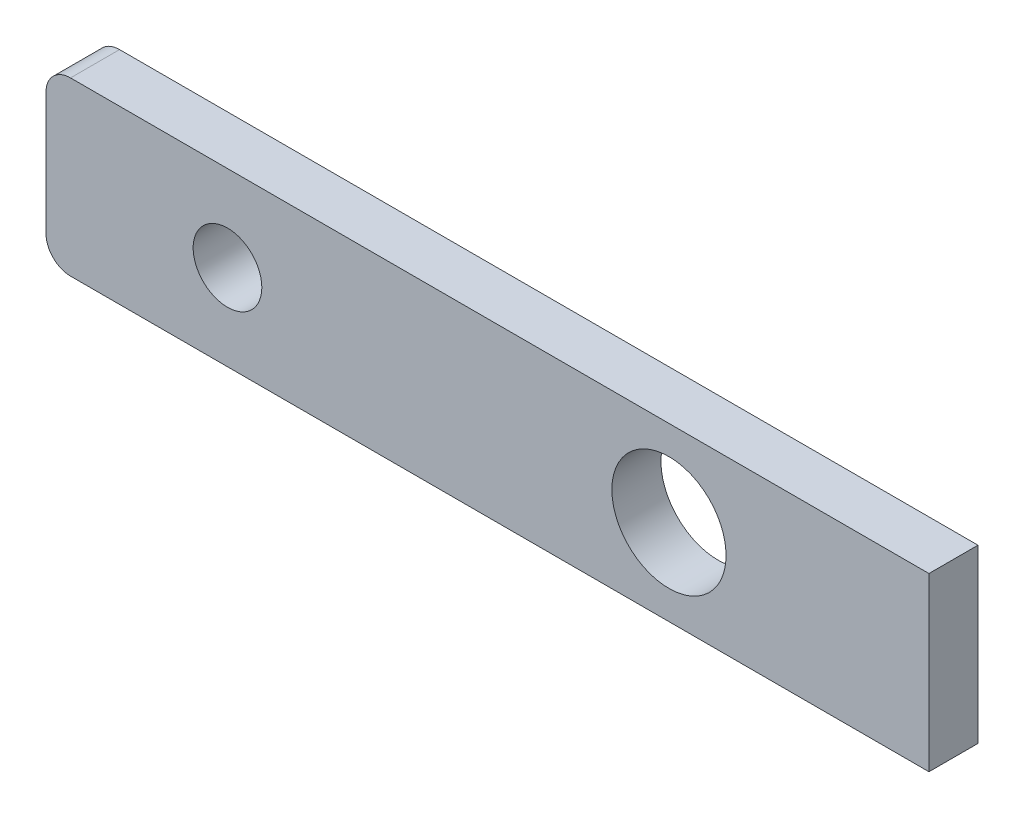
ISO-10303-21;
HEADER;
FILE_DESCRIPTION(('STEP AP214'),'2;1');
FILE_NAME('part.step','',(''),(''),'','','');
FILE_SCHEMA(('AUTOMOTIVE_DESIGN { 1 0 10303 214 1 1 1 1 }'));
ENDSEC;
DATA;
#1=APPLICATION_CONTEXT('core data for automotive mechanical design processes');
#2=APPLICATION_PROTOCOL_DEFINITION('international standard','automotive_design',2000,#1);
#3=PRODUCT_CONTEXT('',#1,'mechanical');
#4=PRODUCT('Part','Part','',(#3));
#5=PRODUCT_RELATED_PRODUCT_CATEGORY('part','',(#4));
#6=PRODUCT_DEFINITION_FORMATION('','',#4);
#7=PRODUCT_DEFINITION_CONTEXT('part definition',#1,'design');
#8=PRODUCT_DEFINITION('design','',#6,#7);
#9=PRODUCT_DEFINITION_SHAPE('','',#8);
#10=(LENGTH_UNIT() NAMED_UNIT(*) SI_UNIT(.MILLI.,.METRE.));
#11=(NAMED_UNIT(*) PLANE_ANGLE_UNIT() SI_UNIT($,.RADIAN.));
#12=(NAMED_UNIT(*) SI_UNIT($,.STERADIAN.) SOLID_ANGLE_UNIT());
#13=UNCERTAINTY_MEASURE_WITH_UNIT(LENGTH_MEASURE(1.E-05),#10,'distance_accuracy_value','');
#14=(GEOMETRIC_REPRESENTATION_CONTEXT(3) GLOBAL_UNCERTAINTY_ASSIGNED_CONTEXT((#13)) GLOBAL_UNIT_ASSIGNED_CONTEXT((#10,
#11,#12)) REPRESENTATION_CONTEXT('',''));
#15=CARTESIAN_POINT('',(0.,0.,0.));
#16=DIRECTION('',(0.,0.,1.));
#17=DIRECTION('',(1.,0.,0.));
#18=AXIS2_PLACEMENT_3D('',#15,#16,#17);
#19=CARTESIAN_POINT('',(8.99999999999995,1.75000000000002,1.));
#20=DIRECTION('',(-1.,0.,0.));
#21=DIRECTION('',(0.,-1.,0.));
#22=AXIS2_PLACEMENT_3D('',#19,#20,#21);
#23=PLANE('',#22);
#24=DIRECTION('',(0.,1.,0.));
#25=VECTOR('',#24,1.);
#26=CARTESIAN_POINT('',(8.99999999999995,1.75000000000002,0.));
#27=LINE('',#26,#25);
#28=CARTESIAN_POINT('',(8.99999999999998,-1.74999999999998,0.));
#29=VERTEX_POINT('',#28);
#30=CARTESIAN_POINT('',(8.99999999999995,1.75000000000002,0.));
#31=VERTEX_POINT('',#30);
#32=EDGE_CURVE('E107',#29,#31,#27,.T.);
#33=ORIENTED_EDGE('',*,*,#32,.T.);
#34=DIRECTION('',(0.,0.,-1.));
#35=VECTOR('',#34,1.);
#36=CARTESIAN_POINT('',(8.99999999999995,1.75000000000002,1.));
#37=LINE('',#36,#35);
#38=CARTESIAN_POINT('',(8.99999999999995,1.75000000000002,1.));
#39=VERTEX_POINT('',#38);
#40=EDGE_CURVE('E90',#39,#31,#37,.T.);
#41=ORIENTED_EDGE('',*,*,#40,.F.);
#42=DIRECTION('',(0.,1.,0.));
#43=VECTOR('',#42,1.);
#44=CARTESIAN_POINT('',(8.99999999999995,1.75000000000002,1.));
#45=LINE('',#44,#43);
#46=CARTESIAN_POINT('',(8.99999999999998,-1.74999999999998,1.));
#47=VERTEX_POINT('',#46);
#48=EDGE_CURVE('E95',#47,#39,#45,.T.);
#49=ORIENTED_EDGE('',*,*,#48,.F.);
#50=DIRECTION('',(0.,0.,-1.));
#51=VECTOR('',#50,1.);
#52=CARTESIAN_POINT('',(8.99999999999998,-1.74999999999998,1.));
#53=LINE('',#52,#51);
#54=EDGE_CURVE('E109',#47,#29,#53,.T.);
#55=ORIENTED_EDGE('',*,*,#54,.T.);
#56=EDGE_LOOP('',(#33,#41,#49,#55));
#57=FACE_BOUND('',#56,.T.);
#58=ADVANCED_FACE('F34',(#57),#23,.F.);
#59=CARTESIAN_POINT('',(-9.00000000000001,1.75000000000002,1.));
#60=DIRECTION('',(0.,-1.,0.));
#61=DIRECTION('',(0.,0.,-1.));
#62=AXIS2_PLACEMENT_3D('',#59,#60,#61);
#63=PLANE('',#62);
#64=DIRECTION('',(-1.,0.,0.));
#65=VECTOR('',#64,1.);
#66=CARTESIAN_POINT('',(-9.00000000000001,1.75000000000002,0.));
#67=LINE('',#66,#65);
#68=CARTESIAN_POINT('',(-8.50000000000001,1.75000000000002,0.));
#69=VERTEX_POINT('',#68);
#70=EDGE_CURVE('E139',#31,#69,#67,.T.);
#71=ORIENTED_EDGE('',*,*,#70,.T.);
#72=DIRECTION('',(0.,0.,-1.));
#73=VECTOR('',#72,1.);
#74=CARTESIAN_POINT('',(-8.50000000000001,1.75000000000002,1.));
#75=LINE('',#74,#73);
#76=CARTESIAN_POINT('',(-8.50000000000001,1.75000000000002,1.));
#77=VERTEX_POINT('',#76);
#78=EDGE_CURVE('E12',#69,#77,#75,.F.);
#79=ORIENTED_EDGE('',*,*,#78,.T.);
#80=DIRECTION('',(-1.,0.,0.));
#81=VECTOR('',#80,1.);
#82=CARTESIAN_POINT('',(-9.00000000000001,1.75000000000002,1.));
#83=LINE('',#82,#81);
#84=EDGE_CURVE('E86',#39,#77,#83,.T.);
#85=ORIENTED_EDGE('',*,*,#84,.F.);
#86=ORIENTED_EDGE('',*,*,#40,.T.);
#87=EDGE_LOOP('',(#71,#79,#85,#86));
#88=FACE_BOUND('',#87,.T.);
#89=ADVANCED_FACE('F88',(#88),#63,.F.);
#90=CARTESIAN_POINT('',(-9.00000000000001,1.75000000000002,1.));
#91=DIRECTION('',(1.,0.,0.));
#92=DIRECTION('',(0.,0.,-1.));
#93=AXIS2_PLACEMENT_3D('',#90,#91,#92);
#94=PLANE('',#93);
#95=DIRECTION('',(0.,-1.,0.));
#96=VECTOR('',#95,1.);
#97=CARTESIAN_POINT('',(-9.00000000000001,1.75000000000002,0.));
#98=LINE('',#97,#96);
#99=CARTESIAN_POINT('',(-9.00000000000001,1.25000000000002,0.));
#100=VERTEX_POINT('',#99);
#101=CARTESIAN_POINT('',(-9.00000000000001,-1.24999999999999,0.));
#102=VERTEX_POINT('',#101);
#103=EDGE_CURVE('E136',#100,#102,#98,.T.);
#104=ORIENTED_EDGE('',*,*,#103,.T.);
#105=DIRECTION('',(0.,0.,-1.));
#106=VECTOR('',#105,1.);
#107=CARTESIAN_POINT('',(-9.00000000000001,-1.24999999999999,1.));
#108=LINE('',#107,#106);
#109=CARTESIAN_POINT('',(-9.00000000000001,-1.24999999999999,1.));
#110=VERTEX_POINT('',#109);
#111=EDGE_CURVE('E55',#102,#110,#108,.F.);
#112=ORIENTED_EDGE('',*,*,#111,.T.);
#113=DIRECTION('',(0.,-1.,0.));
#114=VECTOR('',#113,1.);
#115=CARTESIAN_POINT('',(-9.00000000000001,1.75000000000002,1.));
#116=LINE('',#115,#114);
#117=CARTESIAN_POINT('',(-9.00000000000001,1.25000000000002,1.));
#118=VERTEX_POINT('',#117);
#119=EDGE_CURVE('E94',#118,#110,#116,.T.);
#120=ORIENTED_EDGE('',*,*,#119,.F.);
#121=DIRECTION('',(0.,0.,-1.));
#122=VECTOR('',#121,1.);
#123=CARTESIAN_POINT('',(-9.00000000000001,1.25000000000002,1.));
#124=LINE('',#123,#122);
#125=EDGE_CURVE('E120',#118,#100,#124,.T.);
#126=ORIENTED_EDGE('',*,*,#125,.T.);
#127=EDGE_LOOP('',(#104,#112,#120,#126));
#128=FACE_BOUND('',#127,.T.);
#129=ADVANCED_FACE('F137',(#128),#94,.F.);
#130=CARTESIAN_POINT('',(-9.00000000000001,-1.74999999999999,1.));
#131=DIRECTION('',(0.,1.,0.));
#132=DIRECTION('',(-1.,0.,0.));
#133=AXIS2_PLACEMENT_3D('',#130,#131,#132);
#134=PLANE('',#133);
#135=DIRECTION('',(1.,0.,0.));
#136=VECTOR('',#135,1.);
#137=CARTESIAN_POINT('',(-9.00000000000001,-1.74999999999999,1.));
#138=LINE('',#137,#136);
#139=CARTESIAN_POINT('',(-8.50000000000001,-1.74999999999999,1.));
#140=VERTEX_POINT('',#139);
#141=EDGE_CURVE('E100',#140,#47,#138,.T.);
#142=ORIENTED_EDGE('',*,*,#141,.F.);
#143=DIRECTION('',(0.,0.,-1.));
#144=VECTOR('',#143,1.);
#145=CARTESIAN_POINT('',(-8.50000000000001,-1.74999999999999,1.));
#146=LINE('',#145,#144);
#147=CARTESIAN_POINT('',(-8.50000000000001,-1.74999999999999,0.));
#148=VERTEX_POINT('',#147);
#149=EDGE_CURVE('E108',#140,#148,#146,.T.);
#150=ORIENTED_EDGE('',*,*,#149,.T.);
#151=DIRECTION('',(1.,0.,0.));
#152=VECTOR('',#151,1.);
#153=CARTESIAN_POINT('',(-9.00000000000001,-1.74999999999999,0.));
#154=LINE('',#153,#152);
#155=EDGE_CURVE('E104',#148,#29,#154,.T.);
#156=ORIENTED_EDGE('',*,*,#155,.T.);
#157=ORIENTED_EDGE('',*,*,#54,.F.);
#158=EDGE_LOOP('',(#142,#150,#156,#157));
#159=FACE_BOUND('',#158,.T.);
#160=ADVANCED_FACE('F129',(#159),#134,.F.);
#161=CARTESIAN_POINT('',(0.,0.,1.));
#162=DIRECTION('',(0.,0.,1.));
#163=DIRECTION('',(1.,0.,0.));
#164=AXIS2_PLACEMENT_3D('',#161,#162,#163);
#165=PLANE('',#164);
#166=CARTESIAN_POINT('',(3.7,0.,1.));
#167=DIRECTION('',(0.,0.,-1.));
#168=DIRECTION('',(-1.,0.,0.));
#169=AXIS2_PLACEMENT_3D('',#166,#167,#168);
#170=CIRCLE('',#169,1.16401377661176);
#171=CARTESIAN_POINT('',(2.53598622338824,0.,1.));
#172=VERTEX_POINT('',#171);
#173=EDGE_CURVE('E149',#172,#172,#170,.T.);
#174=ORIENTED_EDGE('',*,*,#173,.T.);
#175=EDGE_LOOP('',(#174));
#176=FACE_BOUND('',#175,.T.);
#177=CARTESIAN_POINT('',(-5.30000000000001,0.,1.));
#178=DIRECTION('',(0.,0.,1.));
#179=DIRECTION('',(1.,0.,0.));
#180=AXIS2_PLACEMENT_3D('',#177,#178,#179);
#181=CIRCLE('',#180,0.7);
#182=CARTESIAN_POINT('',(-4.60000000000001,0.,1.));
#183=VERTEX_POINT('',#182);
#184=EDGE_CURVE('E146',#183,#183,#181,.T.);
#185=ORIENTED_EDGE('',*,*,#184,.F.);
#186=EDGE_LOOP('',(#185));
#187=FACE_BOUND('',#186,.T.);
#188=ORIENTED_EDGE('',*,*,#119,.T.);
#189=CARTESIAN_POINT('',(-8.50000000000001,-1.24999999999999,1.));
#190=DIRECTION('',(0.,0.,1.));
#191=DIRECTION('',(1.,0.,0.));
#192=AXIS2_PLACEMENT_3D('',#189,#190,#191);
#193=CIRCLE('',#192,0.5);
#194=EDGE_CURVE('E42',#110,#140,#193,.T.);
#195=ORIENTED_EDGE('',*,*,#194,.T.);
#196=ORIENTED_EDGE('',*,*,#141,.T.);
#197=ORIENTED_EDGE('',*,*,#48,.T.);
#198=ORIENTED_EDGE('',*,*,#84,.T.);
#199=CARTESIAN_POINT('',(-8.50000000000001,1.25000000000002,1.));
#200=DIRECTION('',(0.,0.,1.));
#201=DIRECTION('',(1.,0.,0.));
#202=AXIS2_PLACEMENT_3D('',#199,#200,#201);
#203=CIRCLE('',#202,0.5);
#204=EDGE_CURVE('E124',#77,#118,#203,.T.);
#205=ORIENTED_EDGE('',*,*,#204,.T.);
#206=EDGE_LOOP('',(#188,#195,#196,#197,#198,#205));
#207=FACE_BOUND('',#206,.T.);
#208=ADVANCED_FACE('F98',(#176,#187,#207),#165,.T.);
#209=CARTESIAN_POINT('',(0.,0.,0.));
#210=DIRECTION('',(0.,0.,1.));
#211=DIRECTION('',(1.,0.,0.));
#212=AXIS2_PLACEMENT_3D('',#209,#210,#211);
#213=PLANE('',#212);
#214=CARTESIAN_POINT('',(3.7,0.,0.));
#215=DIRECTION('',(0.,0.,-1.));
#216=DIRECTION('',(-1.,0.,0.));
#217=AXIS2_PLACEMENT_3D('',#214,#215,#216);
#218=CIRCLE('',#217,1.16401377661176);
#219=CARTESIAN_POINT('',(2.53598622338824,0.,0.));
#220=VERTEX_POINT('',#219);
#221=EDGE_CURVE('E152',#220,#220,#218,.T.);
#222=ORIENTED_EDGE('',*,*,#221,.F.);
#223=EDGE_LOOP('',(#222));
#224=FACE_BOUND('',#223,.T.);
#225=CARTESIAN_POINT('',(-5.30000000000001,0.,0.));
#226=DIRECTION('',(0.,0.,1.));
#227=DIRECTION('',(1.,0.,0.));
#228=AXIS2_PLACEMENT_3D('',#225,#226,#227);
#229=CIRCLE('',#228,0.7);
#230=CARTESIAN_POINT('',(-4.60000000000001,0.,0.));
#231=VERTEX_POINT('',#230);
#232=EDGE_CURVE('E143',#231,#231,#229,.T.);
#233=ORIENTED_EDGE('',*,*,#232,.T.);
#234=EDGE_LOOP('',(#233));
#235=FACE_BOUND('',#234,.T.);
#236=ORIENTED_EDGE('',*,*,#155,.F.);
#237=CARTESIAN_POINT('',(-8.50000000000001,-1.24999999999999,0.));
#238=DIRECTION('',(0.,0.,1.));
#239=DIRECTION('',(1.,0.,0.));
#240=AXIS2_PLACEMENT_3D('',#237,#238,#239);
#241=CIRCLE('',#240,0.5);
#242=EDGE_CURVE('E118',#148,#102,#241,.F.);
#243=ORIENTED_EDGE('',*,*,#242,.T.);
#244=ORIENTED_EDGE('',*,*,#103,.F.);
#245=CARTESIAN_POINT('',(-8.50000000000001,1.25000000000002,0.));
#246=DIRECTION('',(0.,0.,1.));
#247=DIRECTION('',(1.,0.,0.));
#248=AXIS2_PLACEMENT_3D('',#245,#246,#247);
#249=CIRCLE('',#248,0.5);
#250=EDGE_CURVE('E112',#100,#69,#249,.F.);
#251=ORIENTED_EDGE('',*,*,#250,.T.);
#252=ORIENTED_EDGE('',*,*,#70,.F.);
#253=ORIENTED_EDGE('',*,*,#32,.F.);
#254=EDGE_LOOP('',(#236,#243,#244,#251,#252,#253));
#255=FACE_BOUND('',#254,.T.);
#256=ADVANCED_FACE('F135',(#224,#235,#255),#213,.F.);
#257=CARTESIAN_POINT('',(-5.30000000000001,0.,0.));
#258=DIRECTION('',(0.,0.,1.));
#259=DIRECTION('',(1.,0.,0.));
#260=AXIS2_PLACEMENT_3D('',#257,#258,#259);
#261=CYLINDRICAL_SURFACE('',#260,0.7);
#262=ORIENTED_EDGE('',*,*,#232,.F.);
#263=EDGE_LOOP('',(#262));
#264=FACE_BOUND('',#263,.T.);
#265=ORIENTED_EDGE('',*,*,#184,.T.);
#266=EDGE_LOOP('',(#265));
#267=FACE_BOUND('',#266,.T.);
#268=ADVANCED_FACE('F168',(#264,#267),#261,.F.);
#269=CARTESIAN_POINT('',(-8.50000000000001,-1.24999999999999,1.));
#270=DIRECTION('',(0.,0.,-1.));
#271=DIRECTION('',(-1.,0.,0.));
#272=AXIS2_PLACEMENT_3D('',#269,#270,#271);
#273=CYLINDRICAL_SURFACE('',#272,0.5);
#274=ORIENTED_EDGE('',*,*,#194,.F.);
#275=ORIENTED_EDGE('',*,*,#111,.F.);
#276=ORIENTED_EDGE('',*,*,#242,.F.);
#277=ORIENTED_EDGE('',*,*,#149,.F.);
#278=EDGE_LOOP('',(#274,#275,#276,#277));
#279=FACE_BOUND('',#278,.T.);
#280=ADVANCED_FACE('F132',(#279),#273,.T.);
#281=CARTESIAN_POINT('',(-8.50000000000001,1.25000000000002,1.));
#282=DIRECTION('',(0.,0.,-1.));
#283=DIRECTION('',(-1.,0.,0.));
#284=AXIS2_PLACEMENT_3D('',#281,#282,#283);
#285=CYLINDRICAL_SURFACE('',#284,0.5);
#286=ORIENTED_EDGE('',*,*,#204,.F.);
#287=ORIENTED_EDGE('',*,*,#78,.F.);
#288=ORIENTED_EDGE('',*,*,#250,.F.);
#289=ORIENTED_EDGE('',*,*,#125,.F.);
#290=EDGE_LOOP('',(#286,#287,#288,#289));
#291=FACE_BOUND('',#290,.T.);
#292=ADVANCED_FACE('F36',(#291),#285,.T.);
#293=CARTESIAN_POINT('',(3.7,0.,1.));
#294=DIRECTION('',(0.,0.,-1.));
#295=DIRECTION('',(-1.,0.,0.));
#296=AXIS2_PLACEMENT_3D('',#293,#294,#295);
#297=CYLINDRICAL_SURFACE('',#296,1.16401377661176);
#298=ORIENTED_EDGE('',*,*,#173,.F.);
#299=EDGE_LOOP('',(#298));
#300=FACE_BOUND('',#299,.T.);
#301=ORIENTED_EDGE('',*,*,#221,.T.);
#302=EDGE_LOOP('',(#301));
#303=FACE_BOUND('',#302,.T.);
#304=ADVANCED_FACE('F160',(#300,#303),#297,.F.);
#305=CLOSED_SHELL('',(#58,#89,#129,#160,#208,#256,#268,#280,#292,#304));
#306=MANIFOLD_SOLID_BREP('B2',#305);
#307=ADVANCED_BREP_SHAPE_REPRESENTATION('',(#18,#306),#14);
#308=SHAPE_DEFINITION_REPRESENTATION(#9,#307);
ENDSEC;
END-ISO-10303-21;
